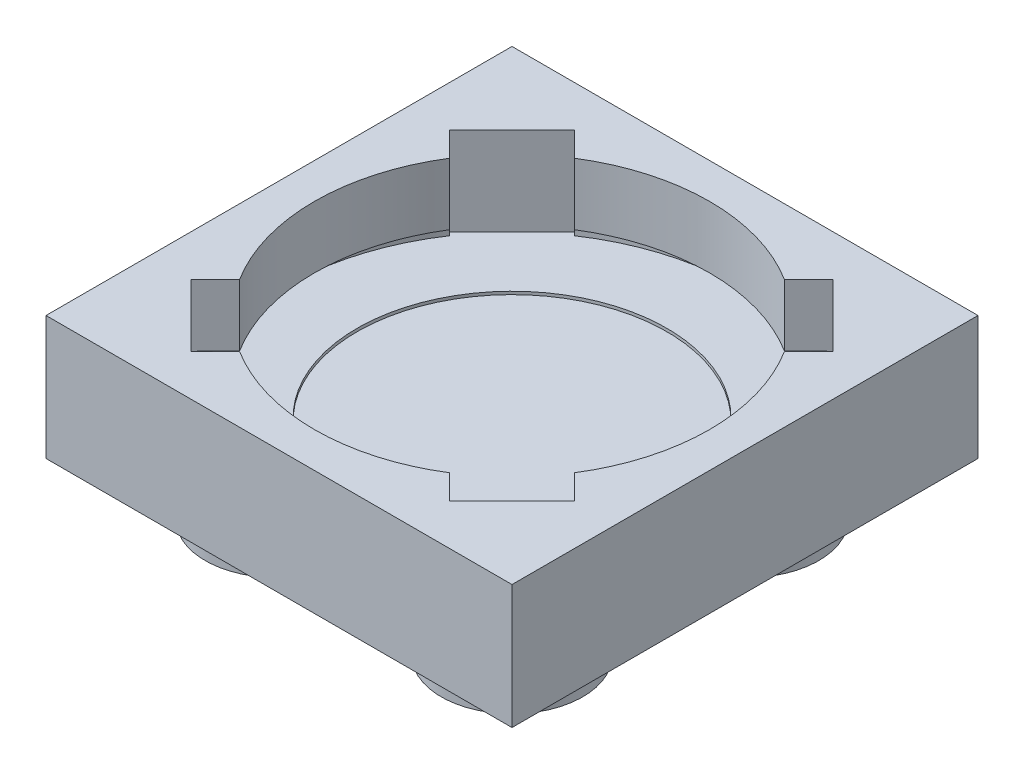
ISO-10303-21;
HEADER;
FILE_DESCRIPTION(('STEP AP214'),'2;1');
FILE_NAME('part.step','',(''),(''),'','','');
FILE_SCHEMA(('AUTOMOTIVE_DESIGN { 1 0 10303 214 1 1 1 1 }'));
ENDSEC;
DATA;
#1=APPLICATION_CONTEXT('core data for automotive mechanical design processes');
#2=APPLICATION_PROTOCOL_DEFINITION('international standard','automotive_design',2000,#1);
#3=PRODUCT_CONTEXT('',#1,'mechanical');
#4=PRODUCT('Part','Part','',(#3));
#5=PRODUCT_RELATED_PRODUCT_CATEGORY('part','',(#4));
#6=PRODUCT_DEFINITION_FORMATION('','',#4);
#7=PRODUCT_DEFINITION_CONTEXT('part definition',#1,'design');
#8=PRODUCT_DEFINITION('design','',#6,#7);
#9=PRODUCT_DEFINITION_SHAPE('','',#8);
#10=(LENGTH_UNIT() NAMED_UNIT(*) SI_UNIT(.MILLI.,.METRE.));
#11=(NAMED_UNIT(*) PLANE_ANGLE_UNIT() SI_UNIT($,.RADIAN.));
#12=(NAMED_UNIT(*) SI_UNIT($,.STERADIAN.) SOLID_ANGLE_UNIT());
#13=UNCERTAINTY_MEASURE_WITH_UNIT(LENGTH_MEASURE(1.E-05),#10,'distance_accuracy_value','');
#14=(GEOMETRIC_REPRESENTATION_CONTEXT(3) GLOBAL_UNCERTAINTY_ASSIGNED_CONTEXT((#13)) GLOBAL_UNIT_ASSIGNED_CONTEXT((#10,
#11,#12)) REPRESENTATION_CONTEXT('',''));
#15=CARTESIAN_POINT('',(0.,0.,0.));
#16=DIRECTION('',(0.,0.,1.));
#17=DIRECTION('',(1.,0.,0.));
#18=AXIS2_PLACEMENT_3D('',#15,#16,#17);
#19=CARTESIAN_POINT('',(7.9,9.47523086789974,-7.9));
#20=DIRECTION('',(0.,-1.,0.));
#21=DIRECTION('',(0.,0.,-1.));
#22=AXIS2_PLACEMENT_3D('',#19,#20,#21);
#23=CYLINDRICAL_SURFACE('',#22,6.7);
#24=CARTESIAN_POINT('',(7.9,-2.10000000000001,-7.9));
#25=DIRECTION('',(0.,1.,0.));
#26=DIRECTION('',(0.,0.,1.));
#27=AXIS2_PLACEMENT_3D('',#24,#25,#26);
#28=CIRCLE('',#27,6.7);
#29=CARTESIAN_POINT('',(11.4566983804663,-2.10000000000001,-13.5780187240259));
#30=VERTEX_POINT('',#29);
#31=CARTESIAN_POINT('',(4.34330161953374,-2.10000000000001,-13.5780187240259));
#32=VERTEX_POINT('',#31);
#33=EDGE_CURVE('E428',#30,#32,#28,.T.);
#34=ORIENTED_EDGE('',*,*,#33,.F.);
#35=DIRECTION('',(0.,-1.,0.));
#36=VECTOR('',#35,1.);
#37=CARTESIAN_POINT('',(11.4566983804663,9.47523086789974,-13.5780187240259));
#38=LINE('',#37,#36);
#39=CARTESIAN_POINT('',(11.4566983804663,0.,-13.5780187240259));
#40=VERTEX_POINT('',#39);
#41=EDGE_CURVE('E420',#30,#40,#38,.F.);
#42=ORIENTED_EDGE('',*,*,#41,.T.);
#43=CARTESIAN_POINT('',(7.9,0.,-7.9));
#44=DIRECTION('',(0.,-1.,0.));
#45=DIRECTION('',(0.,0.,-1.));
#46=AXIS2_PLACEMENT_3D('',#43,#44,#45);
#47=CIRCLE('',#46,6.7);
#48=CARTESIAN_POINT('',(4.34330161953375,0.,-13.5780187240259));
#49=VERTEX_POINT('',#48);
#50=EDGE_CURVE('E342',#49,#40,#47,.T.);
#51=ORIENTED_EDGE('',*,*,#50,.F.);
#52=DIRECTION('',(0.,-1.,0.));
#53=VECTOR('',#52,1.);
#54=CARTESIAN_POINT('',(4.34330161953375,9.47523086789974,-13.5780187240259));
#55=LINE('',#54,#53);
#56=EDGE_CURVE('E410',#32,#49,#55,.F.);
#57=ORIENTED_EDGE('',*,*,#56,.F.);
#58=EDGE_LOOP('',(#34,#42,#51,#57));
#59=FACE_BOUND('',#58,.T.);
#60=ADVANCED_FACE('F75',(#59),#23,.F.);
#61=CARTESIAN_POINT('',(7.9,-2.10000000000001,-7.9));
#62=DIRECTION('',(0.,1.,0.));
#63=DIRECTION('',(0.,0.,1.));
#64=AXIS2_PLACEMENT_3D('',#61,#62,#63);
#65=CIRCLE('',#64,6.7);
#66=CARTESIAN_POINT('',(13.5780187240259,-2.10000000000001,-4.34330161953374));
#67=VERTEX_POINT('',#66);
#68=CARTESIAN_POINT('',(13.5780187240259,-2.10000000000001,-11.4566983804662));
#69=VERTEX_POINT('',#68);
#70=EDGE_CURVE('E508',#67,#69,#65,.T.);
#71=ORIENTED_EDGE('',*,*,#70,.F.);
#72=DIRECTION('',(0.,-1.,0.));
#73=VECTOR('',#72,1.);
#74=CARTESIAN_POINT('',(13.5780187240259,9.47523086789974,-4.34330161953374));
#75=LINE('',#74,#73);
#76=CARTESIAN_POINT('',(13.5780187240259,0.,-4.34330161953374));
#77=VERTEX_POINT('',#76);
#78=EDGE_CURVE('E416',#67,#77,#75,.F.);
#79=ORIENTED_EDGE('',*,*,#78,.T.);
#80=CARTESIAN_POINT('',(13.5780187240259,0.,-11.4566983804662));
#81=VERTEX_POINT('',#80);
#82=EDGE_CURVE('E346',#81,#77,#47,.T.);
#83=ORIENTED_EDGE('',*,*,#82,.F.);
#84=DIRECTION('',(0.,-1.,0.));
#85=VECTOR('',#84,1.);
#86=CARTESIAN_POINT('',(13.5780187240259,9.47523086789974,-11.4566983804662));
#87=LINE('',#86,#85);
#88=EDGE_CURVE('E422',#69,#81,#87,.F.);
#89=ORIENTED_EDGE('',*,*,#88,.F.);
#90=EDGE_LOOP('',(#71,#79,#83,#89));
#91=FACE_BOUND('',#90,.T.);
#92=ADVANCED_FACE('F506',(#91),#23,.F.);
#93=CARTESIAN_POINT('',(7.9,-2.10000000000001,-7.9));
#94=DIRECTION('',(0.,1.,0.));
#95=DIRECTION('',(0.,0.,1.));
#96=AXIS2_PLACEMENT_3D('',#93,#94,#95);
#97=CIRCLE('',#96,6.7);
#98=CARTESIAN_POINT('',(4.34330161953368,-2.10000000000001,-2.22198127597414));
#99=VERTEX_POINT('',#98);
#100=CARTESIAN_POINT('',(11.4566983804663,-2.10000000000001,-2.2219812759741));
#101=VERTEX_POINT('',#100);
#102=EDGE_CURVE('E520',#99,#101,#97,.T.);
#103=ORIENTED_EDGE('',*,*,#102,.F.);
#104=DIRECTION('',(0.,-1.,0.));
#105=VECTOR('',#104,1.);
#106=CARTESIAN_POINT('',(4.34330161953368,9.47523086789974,-2.22198127597414));
#107=LINE('',#106,#105);
#108=CARTESIAN_POINT('',(4.34330161953368,0.,-2.22198127597414));
#109=VERTEX_POINT('',#108);
#110=EDGE_CURVE('E412',#99,#109,#107,.F.);
#111=ORIENTED_EDGE('',*,*,#110,.T.);
#112=CARTESIAN_POINT('',(11.4566983804663,0.,-2.2219812759741));
#113=VERTEX_POINT('',#112);
#114=EDGE_CURVE('E602',#113,#109,#47,.T.);
#115=ORIENTED_EDGE('',*,*,#114,.F.);
#116=DIRECTION('',(0.,-1.,0.));
#117=VECTOR('',#116,1.);
#118=CARTESIAN_POINT('',(11.4566983804663,9.47523086789974,-2.2219812759741));
#119=LINE('',#118,#117);
#120=EDGE_CURVE('E418',#101,#113,#119,.F.);
#121=ORIENTED_EDGE('',*,*,#120,.F.);
#122=EDGE_LOOP('',(#103,#111,#115,#121));
#123=FACE_BOUND('',#122,.T.);
#124=ADVANCED_FACE('F572',(#123),#23,.F.);
#125=CARTESIAN_POINT('',(0.,-3.,0.));
#126=DIRECTION('',(0.,-1.,0.));
#127=DIRECTION('',(0.,0.,-1.));
#128=AXIS2_PLACEMENT_3D('',#125,#126,#127);
#129=PLANE('',#128);
#130=CARTESIAN_POINT('',(7.9,-3.00000000000001,-7.9));
#131=DIRECTION('',(0.,1.,0.));
#132=DIRECTION('',(0.,0.,1.));
#133=AXIS2_PLACEMENT_3D('',#130,#131,#132);
#134=CIRCLE('',#133,7.7);
#135=CARTESIAN_POINT('',(12.1797517973477,-3.00000000000001,-14.3010721409073));
#136=VERTEX_POINT('',#135);
#137=CARTESIAN_POINT('',(3.62024820265235,-3.00000000000001,-14.3010721409073));
#138=VERTEX_POINT('',#137);
#139=EDGE_CURVE('E271',#136,#138,#134,.T.);
#140=ORIENTED_EDGE('',*,*,#139,.T.);
#141=DIRECTION('',(-0.707106781186549,0.,-0.707106781186546));
#142=VECTOR('',#141,1.);
#143=CARTESIAN_POINT('',(8.96066017177982,-3.,-8.96066017177984));
#144=LINE('',#143,#142);
#145=CARTESIAN_POINT('',(3.5159379566434,-3.,-14.4053823869162));
#146=VERTEX_POINT('',#145);
#147=EDGE_CURVE('E330',#138,#146,#144,.T.);
#148=ORIENTED_EDGE('',*,*,#147,.T.);
#149=DIRECTION('',(0.707106781186547,0.,-0.707106781186548));
#150=VECTOR('',#149,1.);
#151=CARTESIAN_POINT('',(-5.44472221513642,-3.,-5.44472221513641));
#152=LINE('',#151,#150);
#153=CARTESIAN_POINT('',(1.39461761308377,-3.,-12.2840620433566));
#154=VERTEX_POINT('',#153);
#155=EDGE_CURVE('E331',#154,#146,#152,.T.);
#156=ORIENTED_EDGE('',*,*,#155,.F.);
#157=DIRECTION('',(-0.707106781186547,0.,-0.707106781186548));
#158=VECTOR('',#157,1.);
#159=CARTESIAN_POINT('',(6.83933982822018,-3.,-6.83933982822017));
#160=LINE('',#159,#158);
#161=CARTESIAN_POINT('',(1.49892785909271,-3.00000000000001,-12.1797517973477));
#162=VERTEX_POINT('',#161);
#163=EDGE_CURVE('E335',#162,#154,#160,.T.);
#164=ORIENTED_EDGE('',*,*,#163,.F.);
#165=CARTESIAN_POINT('',(1.49892785909266,-3.,-3.62024820265241));
#166=VERTEX_POINT('',#165);
#167=EDGE_CURVE('E90',#162,#166,#134,.T.);
#168=ORIENTED_EDGE('',*,*,#167,.T.);
#169=DIRECTION('',(-0.707106781186554,0.,0.707106781186541));
#170=VECTOR('',#169,1.);
#171=CARTESIAN_POINT('',(6.83933982822017,-3.,-8.96066017177983));
#172=LINE('',#171,#170);
#173=CARTESIAN_POINT('',(1.39461761308372,-3.,-3.51593795664347));
#174=VERTEX_POINT('',#173);
#175=EDGE_CURVE('E309',#166,#174,#172,.T.);
#176=ORIENTED_EDGE('',*,*,#175,.T.);
#177=DIRECTION('',(-0.70710678118654,0.,-0.707106781186555));
#178=VECTOR('',#177,1.);
#179=CARTESIAN_POINT('',(10.3552777848634,-3.,5.44472221513644));
#180=LINE('',#179,#178);
#181=CARTESIAN_POINT('',(3.51593795664333,-3.,-1.39461761308381));
#182=VERTEX_POINT('',#181);
#183=EDGE_CURVE('E310',#182,#174,#180,.T.);
#184=ORIENTED_EDGE('',*,*,#183,.F.);
#185=DIRECTION('',(-0.707106781186556,0.,0.707106781186539));
#186=VECTOR('',#185,1.);
#187=CARTESIAN_POINT('',(8.96066017177982,-3.,-6.83933982822017));
#188=LINE('',#187,#186);
#189=CARTESIAN_POINT('',(3.62024820265228,-3.00000000000001,-1.49892785909275));
#190=VERTEX_POINT('',#189);
#191=EDGE_CURVE('E313',#190,#182,#188,.T.);
#192=ORIENTED_EDGE('',*,*,#191,.F.);
#193=CARTESIAN_POINT('',(12.1797517973477,-3.,-1.49892785909271));
#194=VERTEX_POINT('',#193);
#195=EDGE_CURVE('E97',#190,#194,#134,.T.);
#196=ORIENTED_EDGE('',*,*,#195,.T.);
#197=DIRECTION('',(0.707106781186549,0.,0.707106781186546));
#198=VECTOR('',#197,1.);
#199=CARTESIAN_POINT('',(6.83933982822018,-3.,-6.83933982822016));
#200=LINE('',#199,#198);
#201=CARTESIAN_POINT('',(12.2840620433566,-3.,-1.39461761308376));
#202=VERTEX_POINT('',#201);
#203=EDGE_CURVE('E295',#194,#202,#200,.T.);
#204=ORIENTED_EDGE('',*,*,#203,.T.);
#205=DIRECTION('',(-0.707106781186547,0.,0.707106781186548));
#206=VECTOR('',#205,1.);
#207=CARTESIAN_POINT('',(21.2447222151364,-3.,-10.3552777848636));
#208=LINE('',#207,#206);
#209=CARTESIAN_POINT('',(14.4053823869162,-3.,-3.5159379566434));
#210=VERTEX_POINT('',#209);
#211=EDGE_CURVE('E286',#210,#202,#208,.T.);
#212=ORIENTED_EDGE('',*,*,#211,.F.);
#213=DIRECTION('',(0.707106781186547,0.,0.707106781186548));
#214=VECTOR('',#213,1.);
#215=CARTESIAN_POINT('',(8.96066017177982,-3.,-8.96066017177983));
#216=LINE('',#215,#214);
#217=CARTESIAN_POINT('',(14.3010721409073,-3.00000000000001,-3.62024820265234));
#218=VERTEX_POINT('',#217);
#219=EDGE_CURVE('E276',#218,#210,#216,.T.);
#220=ORIENTED_EDGE('',*,*,#219,.F.);
#221=CARTESIAN_POINT('',(14.3010721409073,-3.,-12.1797517973476));
#222=VERTEX_POINT('',#221);
#223=EDGE_CURVE('E259',#218,#222,#134,.T.);
#224=ORIENTED_EDGE('',*,*,#223,.T.);
#225=DIRECTION('',(0.707106781186549,0.,-0.707106781186546));
#226=VECTOR('',#225,1.);
#227=CARTESIAN_POINT('',(8.96066017177984,-3.,-6.83933982822018));
#228=LINE('',#227,#226);
#229=CARTESIAN_POINT('',(14.4053823869163,-3.,-12.2840620433566));
#230=VERTEX_POINT('',#229);
#231=EDGE_CURVE('E475',#222,#230,#228,.T.);
#232=ORIENTED_EDGE('',*,*,#231,.T.);
#233=DIRECTION('',(0.707106781186545,0.,0.70710678118655));
#234=VECTOR('',#233,1.);
#235=CARTESIAN_POINT('',(5.44472221513646,-3.,-21.2447222151364));
#236=LINE('',#235,#234);
#237=CARTESIAN_POINT('',(12.2840620433566,-3.,-14.4053823869162));
#238=VERTEX_POINT('',#237);
#239=EDGE_CURVE('E476',#238,#230,#236,.T.);
#240=ORIENTED_EDGE('',*,*,#239,.F.);
#241=DIRECTION('',(0.707106781186551,0.,-0.707106781186544));
#242=VECTOR('',#241,1.);
#243=CARTESIAN_POINT('',(6.83933982822017,-3.,-8.96066017177982));
#244=LINE('',#243,#242);
#245=EDGE_CURVE('E479',#136,#238,#244,.T.);
#246=ORIENTED_EDGE('',*,*,#245,.F.);
#247=EDGE_LOOP('',(#140,#148,#156,#164,#168,#176,#184,#192,#196,#204,#212,#220,#224,#232,#240,#246));
#248=FACE_BOUND('',#247,.T.);
#249=CARTESIAN_POINT('',(7.9,-3.,-7.9));
#250=DIRECTION('',(0.,1.,0.));
#251=DIRECTION('',(0.,0.,1.));
#252=AXIS2_PLACEMENT_3D('',#249,#250,#251);
#253=CIRCLE('',#252,5.25);
#254=CARTESIAN_POINT('',(7.9,-3.,-2.65));
#255=VERTEX_POINT('',#254);
#256=EDGE_CURVE('E345',#255,#255,#253,.T.);
#257=ORIENTED_EDGE('',*,*,#256,.F.);
#258=EDGE_LOOP('',(#257));
#259=FACE_BOUND('',#258,.T.);
#260=ADVANCED_FACE('F284',(#248,#259),#129,.F.);
#261=CARTESIAN_POINT('',(3.9,-6.,-3.9));
#262=DIRECTION('',(0.,-1.,0.));
#263=DIRECTION('',(0.,0.,-1.));
#264=AXIS2_PLACEMENT_3D('',#261,#262,#263);
#265=PLANE('',#264);
#266=CARTESIAN_POINT('',(3.9,-6.,-3.9));
#267=DIRECTION('',(0.,-1.,0.));
#268=DIRECTION('',(0.,0.,-1.));
#269=AXIS2_PLACEMENT_3D('',#266,#267,#268);
#270=CIRCLE('',#269,2.4);
#271=CARTESIAN_POINT('',(3.9,-6.,-6.3));
#272=VERTEX_POINT('',#271);
#273=EDGE_CURVE('E405',#272,#272,#270,.T.);
#274=ORIENTED_EDGE('',*,*,#273,.T.);
#275=EDGE_LOOP('',(#274));
#276=FACE_BOUND('',#275,.T.);
#277=ADVANCED_FACE('F77',(#276),#265,.T.);
#278=CARTESIAN_POINT('',(3.9,-6.,-3.9));
#279=DIRECTION('',(0.,1.,0.));
#280=DIRECTION('',(0.,0.,1.));
#281=AXIS2_PLACEMENT_3D('',#278,#279,#280);
#282=CYLINDRICAL_SURFACE('',#281,2.4);
#283=ORIENTED_EDGE('',*,*,#273,.F.);
#284=EDGE_LOOP('',(#283));
#285=FACE_BOUND('',#284,.T.);
#286=CARTESIAN_POINT('',(3.9,-4.2,-3.9));
#287=DIRECTION('',(0.,-1.,0.));
#288=DIRECTION('',(0.,0.,-1.));
#289=AXIS2_PLACEMENT_3D('',#286,#287,#288);
#290=CIRCLE('',#289,2.4);
#291=CARTESIAN_POINT('',(3.9,-4.2,-6.3));
#292=VERTEX_POINT('',#291);
#293=EDGE_CURVE('E402',#292,#292,#290,.T.);
#294=ORIENTED_EDGE('',*,*,#293,.T.);
#295=EDGE_LOOP('',(#294));
#296=FACE_BOUND('',#295,.T.);
#297=ADVANCED_FACE('F853',(#285,#296),#282,.T.);
#298=CARTESIAN_POINT('',(3.9,-6.,-11.9));
#299=DIRECTION('',(0.,-1.,0.));
#300=DIRECTION('',(0.,0.,-1.));
#301=AXIS2_PLACEMENT_3D('',#298,#299,#300);
#302=PLANE('',#301);
#303=CARTESIAN_POINT('',(3.9,-6.,-11.9));
#304=DIRECTION('',(0.,-1.,0.));
#305=DIRECTION('',(0.,0.,-1.));
#306=AXIS2_PLACEMENT_3D('',#303,#304,#305);
#307=CIRCLE('',#306,2.4);
#308=CARTESIAN_POINT('',(3.9,-6.,-14.3));
#309=VERTEX_POINT('',#308);
#310=EDGE_CURVE('E399',#309,#309,#307,.T.);
#311=ORIENTED_EDGE('',*,*,#310,.T.);
#312=EDGE_LOOP('',(#311));
#313=FACE_BOUND('',#312,.T.);
#314=ADVANCED_FACE('F842',(#313),#302,.T.);
#315=CARTESIAN_POINT('',(3.9,-6.,-11.9));
#316=DIRECTION('',(0.,1.,0.));
#317=DIRECTION('',(0.,0.,1.));
#318=AXIS2_PLACEMENT_3D('',#315,#316,#317);
#319=CYLINDRICAL_SURFACE('',#318,2.4);
#320=ORIENTED_EDGE('',*,*,#310,.F.);
#321=EDGE_LOOP('',(#320));
#322=FACE_BOUND('',#321,.T.);
#323=CARTESIAN_POINT('',(3.9,-4.2,-11.9));
#324=DIRECTION('',(0.,-1.,0.));
#325=DIRECTION('',(0.,0.,-1.));
#326=AXIS2_PLACEMENT_3D('',#323,#324,#325);
#327=CIRCLE('',#326,2.4);
#328=CARTESIAN_POINT('',(3.9,-4.2,-14.3));
#329=VERTEX_POINT('',#328);
#330=EDGE_CURVE('E391',#329,#329,#327,.T.);
#331=ORIENTED_EDGE('',*,*,#330,.T.);
#332=EDGE_LOOP('',(#331));
#333=FACE_BOUND('',#332,.T.);
#334=ADVANCED_FACE('F837',(#322,#333),#319,.T.);
#335=CARTESIAN_POINT('',(0.,-4.2,0.));
#336=DIRECTION('',(-1.,0.,0.));
#337=DIRECTION('',(0.,0.,1.));
#338=AXIS2_PLACEMENT_3D('',#335,#336,#337);
#339=PLANE('',#338);
#340=DIRECTION('',(0.,0.,1.));
#341=VECTOR('',#340,1.);
#342=CARTESIAN_POINT('',(0.,0.,0.));
#343=LINE('',#342,#341);
#344=CARTESIAN_POINT('',(0.,0.,-15.8));
#345=VERTEX_POINT('',#344);
#346=CARTESIAN_POINT('',(0.,0.,0.));
#347=VERTEX_POINT('',#346);
#348=EDGE_CURVE('E362',#345,#347,#343,.T.);
#349=ORIENTED_EDGE('',*,*,#348,.F.);
#350=DIRECTION('',(0.,1.,0.));
#351=VECTOR('',#350,1.);
#352=CARTESIAN_POINT('',(0.,-4.2,-15.8));
#353=LINE('',#352,#351);
#354=CARTESIAN_POINT('',(0.,-4.2,-15.8));
#355=VERTEX_POINT('',#354);
#356=EDGE_CURVE('E389',#355,#345,#353,.T.);
#357=ORIENTED_EDGE('',*,*,#356,.F.);
#358=DIRECTION('',(0.,0.,1.));
#359=VECTOR('',#358,1.);
#360=CARTESIAN_POINT('',(0.,-4.2,0.));
#361=LINE('',#360,#359);
#362=CARTESIAN_POINT('',(0.,-4.2,0.));
#363=VERTEX_POINT('',#362);
#364=EDGE_CURVE('E365',#355,#363,#361,.T.);
#365=ORIENTED_EDGE('',*,*,#364,.T.);
#366=DIRECTION('',(0.,1.,0.));
#367=VECTOR('',#366,1.);
#368=CARTESIAN_POINT('',(0.,-4.2,0.));
#369=LINE('',#368,#367);
#370=EDGE_CURVE('E378',#363,#347,#369,.T.);
#371=ORIENTED_EDGE('',*,*,#370,.T.);
#372=EDGE_LOOP('',(#349,#357,#365,#371));
#373=FACE_BOUND('',#372,.T.);
#374=ADVANCED_FACE('F841',(#373),#339,.T.);
#375=CARTESIAN_POINT('',(0.,-4.2,-15.8));
#376=DIRECTION('',(0.,0.,-1.));
#377=DIRECTION('',(-1.,0.,0.));
#378=AXIS2_PLACEMENT_3D('',#375,#376,#377);
#379=PLANE('',#378);
#380=DIRECTION('',(-1.,0.,0.));
#381=VECTOR('',#380,1.);
#382=CARTESIAN_POINT('',(0.,0.,-15.8));
#383=LINE('',#382,#381);
#384=CARTESIAN_POINT('',(15.8,0.,-15.8));
#385=VERTEX_POINT('',#384);
#386=EDGE_CURVE('E369',#385,#345,#383,.T.);
#387=ORIENTED_EDGE('',*,*,#386,.F.);
#388=DIRECTION('',(0.,1.,0.));
#389=VECTOR('',#388,1.);
#390=CARTESIAN_POINT('',(15.8,-4.2,-15.8));
#391=LINE('',#390,#389);
#392=CARTESIAN_POINT('',(15.8,-4.2,-15.8));
#393=VERTEX_POINT('',#392);
#394=EDGE_CURVE('E392',#393,#385,#391,.T.);
#395=ORIENTED_EDGE('',*,*,#394,.F.);
#396=DIRECTION('',(-1.,0.,0.));
#397=VECTOR('',#396,1.);
#398=CARTESIAN_POINT('',(0.,-4.2,-15.8));
#399=LINE('',#398,#397);
#400=EDGE_CURVE('E375',#393,#355,#399,.T.);
#401=ORIENTED_EDGE('',*,*,#400,.T.);
#402=ORIENTED_EDGE('',*,*,#356,.T.);
#403=EDGE_LOOP('',(#387,#395,#401,#402));
#404=FACE_BOUND('',#403,.T.);
#405=ADVANCED_FACE('F902',(#404),#379,.T.);
#406=CARTESIAN_POINT('',(15.8,-4.2,0.));
#407=DIRECTION('',(1.,0.,0.));
#408=DIRECTION('',(0.,0.,-1.));
#409=AXIS2_PLACEMENT_3D('',#406,#407,#408);
#410=PLANE('',#409);
#411=DIRECTION('',(0.,0.,-1.));
#412=VECTOR('',#411,1.);
#413=CARTESIAN_POINT('',(15.8,0.,0.));
#414=LINE('',#413,#412);
#415=CARTESIAN_POINT('',(15.8,0.,0.));
#416=VERTEX_POINT('',#415);
#417=EDGE_CURVE('E384',#416,#385,#414,.T.);
#418=ORIENTED_EDGE('',*,*,#417,.F.);
#419=DIRECTION('',(0.,1.,0.));
#420=VECTOR('',#419,1.);
#421=CARTESIAN_POINT('',(15.8,-4.2,0.));
#422=LINE('',#421,#420);
#423=CARTESIAN_POINT('',(15.8,-4.2,0.));
#424=VERTEX_POINT('',#423);
#425=EDGE_CURVE('E394',#424,#416,#422,.T.);
#426=ORIENTED_EDGE('',*,*,#425,.F.);
#427=DIRECTION('',(0.,0.,-1.));
#428=VECTOR('',#427,1.);
#429=CARTESIAN_POINT('',(15.8,-4.2,0.));
#430=LINE('',#429,#428);
#431=EDGE_CURVE('E372',#424,#393,#430,.T.);
#432=ORIENTED_EDGE('',*,*,#431,.T.);
#433=ORIENTED_EDGE('',*,*,#394,.T.);
#434=EDGE_LOOP('',(#418,#426,#432,#433));
#435=FACE_BOUND('',#434,.T.);
#436=ADVANCED_FACE('F892',(#435),#410,.T.);
#437=CARTESIAN_POINT('',(0.,-4.2,0.));
#438=DIRECTION('',(0.,0.,1.));
#439=DIRECTION('',(1.,0.,0.));
#440=AXIS2_PLACEMENT_3D('',#437,#438,#439);
#441=PLANE('',#440);
#442=DIRECTION('',(1.,0.,0.));
#443=VECTOR('',#442,1.);
#444=CARTESIAN_POINT('',(0.,0.,0.));
#445=LINE('',#444,#443);
#446=EDGE_CURVE('E381',#347,#416,#445,.T.);
#447=ORIENTED_EDGE('',*,*,#446,.F.);
#448=ORIENTED_EDGE('',*,*,#370,.F.);
#449=DIRECTION('',(1.,0.,0.));
#450=VECTOR('',#449,1.);
#451=CARTESIAN_POINT('',(0.,-4.2,0.));
#452=LINE('',#451,#450);
#453=EDGE_CURVE('E368',#363,#424,#452,.T.);
#454=ORIENTED_EDGE('',*,*,#453,.T.);
#455=ORIENTED_EDGE('',*,*,#425,.T.);
#456=EDGE_LOOP('',(#447,#448,#454,#455));
#457=FACE_BOUND('',#456,.T.);
#458=ADVANCED_FACE('F828',(#457),#441,.T.);
#459=CARTESIAN_POINT('',(0.,-4.2,0.));
#460=DIRECTION('',(0.,-1.,0.));
#461=DIRECTION('',(0.,0.,-1.));
#462=AXIS2_PLACEMENT_3D('',#459,#460,#461);
#463=PLANE('',#462);
#464=CARTESIAN_POINT('',(11.9,-4.2,-3.9));
#465=DIRECTION('',(0.,-1.,0.));
#466=DIRECTION('',(0.,0.,-1.));
#467=AXIS2_PLACEMENT_3D('',#464,#465,#466);
#468=CIRCLE('',#467,2.4);
#469=CARTESIAN_POINT('',(11.9,-4.2,-6.3));
#470=VERTEX_POINT('',#469);
#471=EDGE_CURVE('E350',#470,#470,#468,.T.);
#472=ORIENTED_EDGE('',*,*,#471,.F.);
#473=EDGE_LOOP('',(#472));
#474=FACE_BOUND('',#473,.T.);
#475=CARTESIAN_POINT('',(11.9,-4.2,-11.9));
#476=DIRECTION('',(0.,-1.,0.));
#477=DIRECTION('',(0.,0.,-1.));
#478=AXIS2_PLACEMENT_3D('',#475,#476,#477);
#479=CIRCLE('',#478,2.4);
#480=CARTESIAN_POINT('',(11.9,-4.2,-14.3));
#481=VERTEX_POINT('',#480);
#482=EDGE_CURVE('E358',#481,#481,#479,.T.);
#483=ORIENTED_EDGE('',*,*,#482,.F.);
#484=EDGE_LOOP('',(#483));
#485=FACE_BOUND('',#484,.T.);
#486=ORIENTED_EDGE('',*,*,#364,.F.);
#487=ORIENTED_EDGE('',*,*,#400,.F.);
#488=ORIENTED_EDGE('',*,*,#431,.F.);
#489=ORIENTED_EDGE('',*,*,#453,.F.);
#490=EDGE_LOOP('',(#486,#487,#488,#489));
#491=FACE_BOUND('',#490,.T.);
#492=ORIENTED_EDGE('',*,*,#330,.F.);
#493=EDGE_LOOP('',(#492));
#494=FACE_BOUND('',#493,.T.);
#495=ORIENTED_EDGE('',*,*,#293,.F.);
#496=EDGE_LOOP('',(#495));
#497=FACE_BOUND('',#496,.T.);
#498=ADVANCED_FACE('F777',(#474,#485,#491,#494,#497),#463,.T.);
#499=CARTESIAN_POINT('',(0.,0.,0.));
#500=DIRECTION('',(0.,-1.,0.));
#501=DIRECTION('',(0.,0.,-1.));
#502=AXIS2_PLACEMENT_3D('',#499,#500,#501);
#503=PLANE('',#502);
#504=DIRECTION('',(0.707106781186545,0.,0.70710678118655));
#505=VECTOR('',#504,1.);
#506=CARTESIAN_POINT('',(5.44472221513646,0.,-21.2447222151364));
#507=LINE('',#506,#505);
#508=CARTESIAN_POINT('',(12.2840620433566,0.,-14.4053823869162));
#509=VERTEX_POINT('',#508);
#510=CARTESIAN_POINT('',(14.4053823869163,0.,-12.2840620433566));
#511=VERTEX_POINT('',#510);
#512=EDGE_CURVE('E449',#509,#511,#507,.T.);
#513=ORIENTED_EDGE('',*,*,#512,.T.);
#514=DIRECTION('',(0.707106781186549,0.,-0.707106781186546));
#515=VECTOR('',#514,1.);
#516=CARTESIAN_POINT('',(8.96066017177984,0.,-6.83933982822018));
#517=LINE('',#516,#515);
#518=EDGE_CURVE('E473',#81,#511,#517,.T.);
#519=ORIENTED_EDGE('',*,*,#518,.F.);
#520=ORIENTED_EDGE('',*,*,#82,.T.);
#521=DIRECTION('',(0.707106781186547,0.,0.707106781186548));
#522=VECTOR('',#521,1.);
#523=CARTESIAN_POINT('',(8.96066017177982,0.,-8.96066017177983));
#524=LINE('',#523,#522);
#525=CARTESIAN_POINT('',(14.4053823869162,0.,-3.5159379566434));
#526=VERTEX_POINT('',#525);
#527=EDGE_CURVE('E481',#77,#526,#524,.T.);
#528=ORIENTED_EDGE('',*,*,#527,.T.);
#529=DIRECTION('',(-0.707106781186547,0.,0.707106781186548));
#530=VECTOR('',#529,1.);
#531=CARTESIAN_POINT('',(21.2447222151364,0.,-10.3552777848636));
#532=LINE('',#531,#530);
#533=CARTESIAN_POINT('',(12.2840620433566,0.,-1.39461761308376));
#534=VERTEX_POINT('',#533);
#535=EDGE_CURVE('E300',#526,#534,#532,.T.);
#536=ORIENTED_EDGE('',*,*,#535,.T.);
#537=DIRECTION('',(0.707106781186549,0.,0.707106781186546));
#538=VECTOR('',#537,1.);
#539=CARTESIAN_POINT('',(6.83933982822018,0.,-6.83933982822016));
#540=LINE('',#539,#538);
#541=EDGE_CURVE('E289',#113,#534,#540,.T.);
#542=ORIENTED_EDGE('',*,*,#541,.F.);
#543=ORIENTED_EDGE('',*,*,#114,.T.);
#544=DIRECTION('',(-0.707106781186556,0.,0.707106781186539));
#545=VECTOR('',#544,1.);
#546=CARTESIAN_POINT('',(8.96066017177982,0.,-6.83933982822017));
#547=LINE('',#546,#545);
#548=CARTESIAN_POINT('',(3.51593795664333,0.,-1.39461761308381));
#549=VERTEX_POINT('',#548);
#550=EDGE_CURVE('E287',#109,#549,#547,.T.);
#551=ORIENTED_EDGE('',*,*,#550,.T.);
#552=DIRECTION('',(-0.70710678118654,0.,-0.707106781186555));
#553=VECTOR('',#552,1.);
#554=CARTESIAN_POINT('',(10.3552777848634,0.,5.44472221513644));
#555=LINE('',#554,#553);
#556=CARTESIAN_POINT('',(1.39461761308372,0.,-3.51593795664347));
#557=VERTEX_POINT('',#556);
#558=EDGE_CURVE('E292',#549,#557,#555,.T.);
#559=ORIENTED_EDGE('',*,*,#558,.T.);
#560=DIRECTION('',(-0.707106781186554,0.,0.707106781186541));
#561=VECTOR('',#560,1.);
#562=CARTESIAN_POINT('',(6.83933982822017,0.,-8.96066017177983));
#563=LINE('',#562,#561);
#564=CARTESIAN_POINT('',(2.22198127597406,0.,-4.34330161953381));
#565=VERTEX_POINT('',#564);
#566=EDGE_CURVE('E307',#565,#557,#563,.T.);
#567=ORIENTED_EDGE('',*,*,#566,.F.);
#568=CARTESIAN_POINT('',(2.2219812759741,0.,-11.4566983804663));
#569=VERTEX_POINT('',#568);
#570=EDGE_CURVE('E323',#565,#569,#47,.T.);
#571=ORIENTED_EDGE('',*,*,#570,.T.);
#572=DIRECTION('',(-0.707106781186547,0.,-0.707106781186548));
#573=VECTOR('',#572,1.);
#574=CARTESIAN_POINT('',(6.83933982822018,0.,-6.83933982822017));
#575=LINE('',#574,#573);
#576=CARTESIAN_POINT('',(1.39461761308377,0.,-12.2840620433566));
#577=VERTEX_POINT('',#576);
#578=EDGE_CURVE('E320',#569,#577,#575,.T.);
#579=ORIENTED_EDGE('',*,*,#578,.T.);
#580=DIRECTION('',(0.707106781186547,0.,-0.707106781186548));
#581=VECTOR('',#580,1.);
#582=CARTESIAN_POINT('',(-5.44472221513642,0.,-5.44472221513641));
#583=LINE('',#582,#581);
#584=CARTESIAN_POINT('',(3.5159379566434,0.,-14.4053823869162));
#585=VERTEX_POINT('',#584);
#586=EDGE_CURVE('E324',#577,#585,#583,.T.);
#587=ORIENTED_EDGE('',*,*,#586,.T.);
#588=DIRECTION('',(-0.707106781186549,0.,-0.707106781186546));
#589=VECTOR('',#588,1.);
#590=CARTESIAN_POINT('',(8.96066017177982,0.,-8.96066017177984));
#591=LINE('',#590,#589);
#592=EDGE_CURVE('E328',#49,#585,#591,.T.);
#593=ORIENTED_EDGE('',*,*,#592,.F.);
#594=ORIENTED_EDGE('',*,*,#50,.T.);
#595=DIRECTION('',(0.707106781186551,0.,-0.707106781186544));
#596=VECTOR('',#595,1.);
#597=CARTESIAN_POINT('',(6.83933982822017,0.,-8.96066017177982));
#598=LINE('',#597,#596);
#599=EDGE_CURVE('E337',#40,#509,#598,.T.);
#600=ORIENTED_EDGE('',*,*,#599,.T.);
#601=EDGE_LOOP('',(#513,#519,#520,#528,#536,#542,#543,#551,#559,#567,#571,#579,#587,#593,#594,#600));
#602=FACE_BOUND('',#601,.T.);
#603=ORIENTED_EDGE('',*,*,#348,.T.);
#604=ORIENTED_EDGE('',*,*,#446,.T.);
#605=ORIENTED_EDGE('',*,*,#417,.T.);
#606=ORIENTED_EDGE('',*,*,#386,.T.);
#607=EDGE_LOOP('',(#603,#604,#605,#606));
#608=FACE_BOUND('',#607,.T.);
#609=ADVANCED_FACE('F452',(#602,#608),#503,.F.);
#610=CARTESIAN_POINT('',(11.9,-6.,-11.9));
#611=DIRECTION('',(0.,1.,0.));
#612=DIRECTION('',(0.,0.,1.));
#613=AXIS2_PLACEMENT_3D('',#610,#611,#612);
#614=CYLINDRICAL_SURFACE('',#613,2.4);
#615=CARTESIAN_POINT('',(11.9,-6.,-11.9));
#616=DIRECTION('',(0.,-1.,0.));
#617=DIRECTION('',(0.,0.,-1.));
#618=AXIS2_PLACEMENT_3D('',#615,#616,#617);
#619=CIRCLE('',#618,2.4);
#620=CARTESIAN_POINT('',(11.9,-6.,-14.3));
#621=VERTEX_POINT('',#620);
#622=EDGE_CURVE('E359',#621,#621,#619,.T.);
#623=ORIENTED_EDGE('',*,*,#622,.F.);
#624=EDGE_LOOP('',(#623));
#625=FACE_BOUND('',#624,.T.);
#626=ORIENTED_EDGE('',*,*,#482,.T.);
#627=EDGE_LOOP('',(#626));
#628=FACE_BOUND('',#627,.T.);
#629=ADVANCED_FACE('F776',(#625,#628),#614,.T.);
#630=CARTESIAN_POINT('',(11.9,-6.,-11.9));
#631=DIRECTION('',(0.,-1.,0.));
#632=DIRECTION('',(0.,0.,-1.));
#633=AXIS2_PLACEMENT_3D('',#630,#631,#632);
#634=PLANE('',#633);
#635=ORIENTED_EDGE('',*,*,#622,.T.);
#636=EDGE_LOOP('',(#635));
#637=FACE_BOUND('',#636,.T.);
#638=ADVANCED_FACE('F817',(#637),#634,.T.);
#639=CARTESIAN_POINT('',(11.9,-6.,-3.9));
#640=DIRECTION('',(0.,1.,0.));
#641=DIRECTION('',(0.,0.,1.));
#642=AXIS2_PLACEMENT_3D('',#639,#640,#641);
#643=CYLINDRICAL_SURFACE('',#642,2.4);
#644=CARTESIAN_POINT('',(11.9,-6.,-3.9));
#645=DIRECTION('',(0.,-1.,0.));
#646=DIRECTION('',(0.,0.,-1.));
#647=AXIS2_PLACEMENT_3D('',#644,#645,#646);
#648=CIRCLE('',#647,2.4);
#649=CARTESIAN_POINT('',(11.9,-6.,-6.3));
#650=VERTEX_POINT('',#649);
#651=EDGE_CURVE('E355',#650,#650,#648,.T.);
#652=ORIENTED_EDGE('',*,*,#651,.F.);
#653=EDGE_LOOP('',(#652));
#654=FACE_BOUND('',#653,.T.);
#655=ORIENTED_EDGE('',*,*,#471,.T.);
#656=EDGE_LOOP('',(#655));
#657=FACE_BOUND('',#656,.T.);
#658=ADVANCED_FACE('F807',(#654,#657),#643,.T.);
#659=CARTESIAN_POINT('',(11.9,-6.,-3.9));
#660=DIRECTION('',(0.,-1.,0.));
#661=DIRECTION('',(0.,0.,-1.));
#662=AXIS2_PLACEMENT_3D('',#659,#660,#661);
#663=PLANE('',#662);
#664=ORIENTED_EDGE('',*,*,#651,.T.);
#665=EDGE_LOOP('',(#664));
#666=FACE_BOUND('',#665,.T.);
#667=ADVANCED_FACE('F797',(#666),#663,.T.);
#668=CARTESIAN_POINT('',(7.9,-3.1,-7.9));
#669=DIRECTION('',(0.,1.,0.));
#670=DIRECTION('',(0.,0.,1.));
#671=AXIS2_PLACEMENT_3D('',#668,#669,#670);
#672=CYLINDRICAL_SURFACE('',#671,5.25);
#673=CARTESIAN_POINT('',(7.9,-3.1,-7.9));
#674=DIRECTION('',(0.,1.,0.));
#675=DIRECTION('',(0.,0.,1.));
#676=AXIS2_PLACEMENT_3D('',#673,#674,#675);
#677=CIRCLE('',#676,5.25);
#678=CARTESIAN_POINT('',(7.9,-3.1,-2.65));
#679=VERTEX_POINT('',#678);
#680=EDGE_CURVE('E347',#679,#679,#677,.T.);
#681=ORIENTED_EDGE('',*,*,#680,.F.);
#682=EDGE_LOOP('',(#681));
#683=FACE_BOUND('',#682,.T.);
#684=ORIENTED_EDGE('',*,*,#256,.T.);
#685=EDGE_LOOP('',(#684));
#686=FACE_BOUND('',#685,.T.);
#687=ADVANCED_FACE('F582',(#683,#686),#672,.F.);
#688=CARTESIAN_POINT('',(7.9,-3.1,-7.9));
#689=DIRECTION('',(0.,1.,0.));
#690=DIRECTION('',(0.,0.,1.));
#691=AXIS2_PLACEMENT_3D('',#688,#689,#690);
#692=PLANE('',#691);
#693=ORIENTED_EDGE('',*,*,#680,.T.);
#694=EDGE_LOOP('',(#693));
#695=FACE_BOUND('',#694,.T.);
#696=ADVANCED_FACE('F576',(#695),#692,.T.);
#697=CARTESIAN_POINT('',(7.9,-2.10000000000001,-7.9));
#698=DIRECTION('',(0.,1.,0.));
#699=DIRECTION('',(0.,0.,1.));
#700=AXIS2_PLACEMENT_3D('',#697,#698,#699);
#701=CIRCLE('',#700,6.7);
#702=CARTESIAN_POINT('',(2.2219812759741,-2.10000000000001,-11.4566983804663));
#703=VERTEX_POINT('',#702);
#704=CARTESIAN_POINT('',(2.22198127597406,-2.10000000000001,-4.34330161953381));
#705=VERTEX_POINT('',#704);
#706=EDGE_CURVE('E527',#703,#705,#701,.T.);
#707=ORIENTED_EDGE('',*,*,#706,.F.);
#708=DIRECTION('',(0.,-1.,0.));
#709=VECTOR('',#708,1.);
#710=CARTESIAN_POINT('',(2.2219812759741,9.47523086789974,-11.4566983804663));
#711=LINE('',#710,#709);
#712=EDGE_CURVE('E408',#703,#569,#711,.F.);
#713=ORIENTED_EDGE('',*,*,#712,.T.);
#714=ORIENTED_EDGE('',*,*,#570,.F.);
#715=DIRECTION('',(0.,-1.,0.));
#716=VECTOR('',#715,1.);
#717=CARTESIAN_POINT('',(2.22198127597406,9.47523086789974,-4.34330161953381));
#718=LINE('',#717,#716);
#719=EDGE_CURVE('E414',#705,#565,#718,.F.);
#720=ORIENTED_EDGE('',*,*,#719,.F.);
#721=EDGE_LOOP('',(#707,#713,#714,#720));
#722=FACE_BOUND('',#721,.T.);
#723=ADVANCED_FACE('F568',(#722),#23,.F.);
#724=CARTESIAN_POINT('',(8.96066017177982,-8.65517446877458,-8.96066017177984));
#725=DIRECTION('',(0.707106781186546,0.,-0.707106781186549));
#726=DIRECTION('',(-0.707106781186549,0.,-0.707106781186546));
#727=AXIS2_PLACEMENT_3D('',#724,#725,#726);
#728=PLANE('',#727);
#729=ORIENTED_EDGE('',*,*,#147,.F.);
#730=DIRECTION('',(0.,1.,0.));
#731=VECTOR('',#730,1.);
#732=CARTESIAN_POINT('',(3.62024820265235,0.,-14.3010721409073));
#733=LINE('',#732,#731);
#734=CARTESIAN_POINT('',(3.62024820265235,-2.10000000000001,-14.3010721409073));
#735=VERTEX_POINT('',#734);
#736=EDGE_CURVE('E315',#138,#735,#733,.T.);
#737=ORIENTED_EDGE('',*,*,#736,.T.);
#738=DIRECTION('',(0.707106781186549,0.,0.707106781186546));
#739=VECTOR('',#738,1.);
#740=CARTESIAN_POINT('',(8.96066017177982,-2.10000000000001,-8.96066017177984));
#741=LINE('',#740,#739);
#742=EDGE_CURVE('E439',#735,#32,#741,.T.);
#743=ORIENTED_EDGE('',*,*,#742,.T.);
#744=ORIENTED_EDGE('',*,*,#56,.T.);
#745=ORIENTED_EDGE('',*,*,#592,.T.);
#746=DIRECTION('',(0.,1.,0.));
#747=VECTOR('',#746,1.);
#748=CARTESIAN_POINT('',(3.5159379566434,-8.65517446877458,-14.4053823869162));
#749=LINE('',#748,#747);
#750=EDGE_CURVE('E334',#146,#585,#749,.T.);
#751=ORIENTED_EDGE('',*,*,#750,.F.);
#752=EDGE_LOOP('',(#729,#737,#743,#744,#745,#751));
#753=FACE_BOUND('',#752,.T.);
#754=ADVANCED_FACE('F458',(#753),#728,.F.);
#755=CARTESIAN_POINT('',(-5.44472221513642,-8.65517446877458,-5.44472221513641));
#756=DIRECTION('',(0.707106781186548,0.,0.707106781186547));
#757=DIRECTION('',(0.707106781186547,0.,-0.707106781186548));
#758=AXIS2_PLACEMENT_3D('',#755,#756,#757);
#759=PLANE('',#758);
#760=ORIENTED_EDGE('',*,*,#155,.T.);
#761=ORIENTED_EDGE('',*,*,#750,.T.);
#762=ORIENTED_EDGE('',*,*,#586,.F.);
#763=DIRECTION('',(0.,1.,0.));
#764=VECTOR('',#763,1.);
#765=CARTESIAN_POINT('',(1.39461761308377,-8.65517446877458,-12.2840620433566));
#766=LINE('',#765,#764);
#767=EDGE_CURVE('E327',#154,#577,#766,.T.);
#768=ORIENTED_EDGE('',*,*,#767,.F.);
#769=EDGE_LOOP('',(#760,#761,#762,#768));
#770=FACE_BOUND('',#769,.T.);
#771=ADVANCED_FACE('F460',(#770),#759,.T.);
#772=CARTESIAN_POINT('',(6.83933982822018,-8.65517446877458,-6.83933982822017));
#773=DIRECTION('',(0.707106781186548,0.,-0.707106781186547));
#774=DIRECTION('',(-0.707106781186547,0.,-0.707106781186548));
#775=AXIS2_PLACEMENT_3D('',#772,#773,#774);
#776=PLANE('',#775);
#777=DIRECTION('',(0.,1.,0.));
#778=VECTOR('',#777,1.);
#779=CARTESIAN_POINT('',(1.49892785909271,0.,-12.1797517973477));
#780=LINE('',#779,#778);
#781=CARTESIAN_POINT('',(1.49892785909271,-2.10000000000001,-12.1797517973477));
#782=VERTEX_POINT('',#781);
#783=EDGE_CURVE('E466',#162,#782,#780,.T.);
#784=ORIENTED_EDGE('',*,*,#783,.F.);
#785=ORIENTED_EDGE('',*,*,#163,.T.);
#786=ORIENTED_EDGE('',*,*,#767,.T.);
#787=ORIENTED_EDGE('',*,*,#578,.F.);
#788=ORIENTED_EDGE('',*,*,#712,.F.);
#789=DIRECTION('',(0.707106781186547,0.,0.707106781186548));
#790=VECTOR('',#789,1.);
#791=CARTESIAN_POINT('',(6.83933982822018,-2.10000000000001,-6.83933982822017));
#792=LINE('',#791,#790);
#793=EDGE_CURVE('E529',#782,#703,#792,.T.);
#794=ORIENTED_EDGE('',*,*,#793,.F.);
#795=EDGE_LOOP('',(#784,#785,#786,#787,#788,#794));
#796=FACE_BOUND('',#795,.T.);
#797=ADVANCED_FACE('F609',(#796),#776,.T.);
#798=CARTESIAN_POINT('',(6.83933982822017,-8.65517446877458,-8.96066017177983));
#799=DIRECTION('',(-0.707106781186541,0.,-0.707106781186554));
#800=DIRECTION('',(-0.707106781186554,0.,0.707106781186541));
#801=AXIS2_PLACEMENT_3D('',#798,#799,#800);
#802=PLANE('',#801);
#803=ORIENTED_EDGE('',*,*,#175,.F.);
#804=DIRECTION('',(0.,1.,0.));
#805=VECTOR('',#804,1.);
#806=CARTESIAN_POINT('',(1.49892785909266,0.,-3.62024820265241));
#807=LINE('',#806,#805);
#808=CARTESIAN_POINT('',(1.49892785909266,-2.10000000000001,-3.62024820265241));
#809=VERTEX_POINT('',#808);
#810=EDGE_CURVE('E468',#166,#809,#807,.T.);
#811=ORIENTED_EDGE('',*,*,#810,.T.);
#812=DIRECTION('',(0.707106781186554,0.,-0.707106781186541));
#813=VECTOR('',#812,1.);
#814=CARTESIAN_POINT('',(6.83933982822017,-2.10000000000001,-8.96066017177983));
#815=LINE('',#814,#813);
#816=EDGE_CURVE('E524',#809,#705,#815,.T.);
#817=ORIENTED_EDGE('',*,*,#816,.T.);
#818=ORIENTED_EDGE('',*,*,#719,.T.);
#819=ORIENTED_EDGE('',*,*,#566,.T.);
#820=DIRECTION('',(0.,1.,0.));
#821=VECTOR('',#820,1.);
#822=CARTESIAN_POINT('',(1.39461761308372,-8.65517446877458,-3.51593795664347));
#823=LINE('',#822,#821);
#824=EDGE_CURVE('E312',#174,#557,#823,.T.);
#825=ORIENTED_EDGE('',*,*,#824,.F.);
#826=EDGE_LOOP('',(#803,#811,#817,#818,#819,#825));
#827=FACE_BOUND('',#826,.T.);
#828=ADVANCED_FACE('F537',(#827),#802,.F.);
#829=CARTESIAN_POINT('',(10.3552777848634,-8.65517446877458,5.44472221513644));
#830=DIRECTION('',(0.707106781186555,0.,-0.70710678118654));
#831=DIRECTION('',(-0.70710678118654,0.,-0.707106781186555));
#832=AXIS2_PLACEMENT_3D('',#829,#830,#831);
#833=PLANE('',#832);
#834=ORIENTED_EDGE('',*,*,#183,.T.);
#835=ORIENTED_EDGE('',*,*,#824,.T.);
#836=ORIENTED_EDGE('',*,*,#558,.F.);
#837=DIRECTION('',(0.,1.,0.));
#838=VECTOR('',#837,1.);
#839=CARTESIAN_POINT('',(3.51593795664333,-8.65517446877458,-1.39461761308381));
#840=LINE('',#839,#838);
#841=EDGE_CURVE('E306',#182,#549,#840,.T.);
#842=ORIENTED_EDGE('',*,*,#841,.F.);
#843=EDGE_LOOP('',(#834,#835,#836,#842));
#844=FACE_BOUND('',#843,.T.);
#845=ADVANCED_FACE('F612',(#844),#833,.T.);
#846=CARTESIAN_POINT('',(8.96066017177982,-8.65517446877458,-6.83933982822017));
#847=DIRECTION('',(-0.707106781186539,0.,-0.707106781186556));
#848=DIRECTION('',(-0.707106781186556,0.,0.707106781186539));
#849=AXIS2_PLACEMENT_3D('',#846,#847,#848);
#850=PLANE('',#849);
#851=DIRECTION('',(0.,1.,0.));
#852=VECTOR('',#851,1.);
#853=CARTESIAN_POINT('',(3.62024820265228,0.,-1.49892785909275));
#854=LINE('',#853,#852);
#855=CARTESIAN_POINT('',(3.62024820265228,-2.10000000000001,-1.49892785909275));
#856=VERTEX_POINT('',#855);
#857=EDGE_CURVE('E533',#190,#856,#854,.T.);
#858=ORIENTED_EDGE('',*,*,#857,.F.);
#859=ORIENTED_EDGE('',*,*,#191,.T.);
#860=ORIENTED_EDGE('',*,*,#841,.T.);
#861=ORIENTED_EDGE('',*,*,#550,.F.);
#862=ORIENTED_EDGE('',*,*,#110,.F.);
#863=DIRECTION('',(0.707106781186556,0.,-0.707106781186539));
#864=VECTOR('',#863,1.);
#865=CARTESIAN_POINT('',(8.96066017177982,-2.10000000000001,-6.83933982822017));
#866=LINE('',#865,#864);
#867=EDGE_CURVE('E522',#856,#99,#866,.T.);
#868=ORIENTED_EDGE('',*,*,#867,.F.);
#869=EDGE_LOOP('',(#858,#859,#860,#861,#862,#868));
#870=FACE_BOUND('',#869,.T.);
#871=ADVANCED_FACE('F599',(#870),#850,.T.);
#872=CARTESIAN_POINT('',(6.83933982822018,-8.65517446877458,-6.83933982822016));
#873=DIRECTION('',(-0.707106781186546,0.,0.707106781186549));
#874=DIRECTION('',(0.707106781186549,0.,0.707106781186546));
#875=AXIS2_PLACEMENT_3D('',#872,#873,#874);
#876=PLANE('',#875);
#877=ORIENTED_EDGE('',*,*,#203,.F.);
#878=DIRECTION('',(0.,1.,0.));
#879=VECTOR('',#878,1.);
#880=CARTESIAN_POINT('',(12.1797517973477,0.,-1.49892785909271));
#881=LINE('',#880,#879);
#882=CARTESIAN_POINT('',(12.1797517973477,-2.10000000000001,-1.49892785909271));
#883=VERTEX_POINT('',#882);
#884=EDGE_CURVE('E280',#194,#883,#881,.T.);
#885=ORIENTED_EDGE('',*,*,#884,.T.);
#886=DIRECTION('',(-0.707106781186549,0.,-0.707106781186546));
#887=VECTOR('',#886,1.);
#888=CARTESIAN_POINT('',(6.83933982822018,-2.10000000000001,-6.83933982822016));
#889=LINE('',#888,#887);
#890=EDGE_CURVE('E513',#883,#101,#889,.T.);
#891=ORIENTED_EDGE('',*,*,#890,.T.);
#892=ORIENTED_EDGE('',*,*,#120,.T.);
#893=ORIENTED_EDGE('',*,*,#541,.T.);
#894=DIRECTION('',(0.,1.,0.));
#895=VECTOR('',#894,1.);
#896=CARTESIAN_POINT('',(12.2840620433566,-8.65517446877458,-1.39461761308376));
#897=LINE('',#896,#895);
#898=EDGE_CURVE('E301',#202,#534,#897,.T.);
#899=ORIENTED_EDGE('',*,*,#898,.F.);
#900=EDGE_LOOP('',(#877,#885,#891,#892,#893,#899));
#901=FACE_BOUND('',#900,.T.);
#902=ADVANCED_FACE('F494',(#901),#876,.F.);
#903=CARTESIAN_POINT('',(21.2447222151364,-8.65517446877458,-10.3552777848636));
#904=DIRECTION('',(-0.707106781186548,0.,-0.707106781186547));
#905=DIRECTION('',(-0.707106781186547,0.,0.707106781186548));
#906=AXIS2_PLACEMENT_3D('',#903,#904,#905);
#907=PLANE('',#906);
#908=ORIENTED_EDGE('',*,*,#211,.T.);
#909=ORIENTED_EDGE('',*,*,#898,.T.);
#910=ORIENTED_EDGE('',*,*,#535,.F.);
#911=DIRECTION('',(0.,1.,0.));
#912=VECTOR('',#911,1.);
#913=CARTESIAN_POINT('',(14.4053823869162,-8.65517446877458,-3.5159379566434));
#914=LINE('',#913,#912);
#915=EDGE_CURVE('E298',#210,#526,#914,.T.);
#916=ORIENTED_EDGE('',*,*,#915,.F.);
#917=EDGE_LOOP('',(#908,#909,#910,#916));
#918=FACE_BOUND('',#917,.T.);
#919=ADVANCED_FACE('F497',(#918),#907,.T.);
#920=CARTESIAN_POINT('',(8.96066017177982,-8.65517446877458,-8.96066017177983));
#921=DIRECTION('',(-0.707106781186548,0.,0.707106781186547));
#922=DIRECTION('',(0.707106781186547,0.,0.707106781186548));
#923=AXIS2_PLACEMENT_3D('',#920,#921,#922);
#924=PLANE('',#923);
#925=DIRECTION('',(0.,1.,0.));
#926=VECTOR('',#925,1.);
#927=CARTESIAN_POINT('',(14.3010721409073,0.,-3.62024820265235));
#928=LINE('',#927,#926);
#929=CARTESIAN_POINT('',(14.3010721409073,-2.10000000000001,-3.62024820265234));
#930=VERTEX_POINT('',#929);
#931=EDGE_CURVE('E263',#218,#930,#928,.T.);
#932=ORIENTED_EDGE('',*,*,#931,.F.);
#933=ORIENTED_EDGE('',*,*,#219,.T.);
#934=ORIENTED_EDGE('',*,*,#915,.T.);
#935=ORIENTED_EDGE('',*,*,#527,.F.);
#936=ORIENTED_EDGE('',*,*,#78,.F.);
#937=DIRECTION('',(-0.707106781186547,0.,-0.707106781186548));
#938=VECTOR('',#937,1.);
#939=CARTESIAN_POINT('',(8.96066017177982,-2.10000000000001,-8.96066017177983));
#940=LINE('',#939,#938);
#941=EDGE_CURVE('E279',#930,#67,#940,.T.);
#942=ORIENTED_EDGE('',*,*,#941,.F.);
#943=EDGE_LOOP('',(#932,#933,#934,#935,#936,#942));
#944=FACE_BOUND('',#943,.T.);
#945=ADVANCED_FACE('F275',(#944),#924,.T.);
#946=CARTESIAN_POINT('',(8.96066017177984,-8.65517446877458,-6.83933982822018));
#947=DIRECTION('',(0.707106781186546,0.,0.707106781186549));
#948=DIRECTION('',(0.707106781186549,0.,-0.707106781186546));
#949=AXIS2_PLACEMENT_3D('',#946,#947,#948);
#950=PLANE('',#949);
#951=ORIENTED_EDGE('',*,*,#231,.F.);
#952=DIRECTION('',(0.,1.,0.));
#953=VECTOR('',#952,1.);
#954=CARTESIAN_POINT('',(14.3010721409073,0.,-12.1797517973476));
#955=LINE('',#954,#953);
#956=CARTESIAN_POINT('',(14.3010721409073,-2.10000000000001,-12.1797517973476));
#957=VERTEX_POINT('',#956);
#958=EDGE_CURVE('E266',#222,#957,#955,.T.);
#959=ORIENTED_EDGE('',*,*,#958,.T.);
#960=DIRECTION('',(-0.707106781186549,0.,0.707106781186546));
#961=VECTOR('',#960,1.);
#962=CARTESIAN_POINT('',(8.96066017177984,-2.10000000000001,-6.83933982822018));
#963=LINE('',#962,#961);
#964=EDGE_CURVE('E511',#957,#69,#963,.T.);
#965=ORIENTED_EDGE('',*,*,#964,.T.);
#966=ORIENTED_EDGE('',*,*,#88,.T.);
#967=ORIENTED_EDGE('',*,*,#518,.T.);
#968=DIRECTION('',(0.,1.,0.));
#969=VECTOR('',#968,1.);
#970=CARTESIAN_POINT('',(14.4053823869163,-8.65517446877458,-12.2840620433566));
#971=LINE('',#970,#969);
#972=EDGE_CURVE('E478',#230,#511,#971,.T.);
#973=ORIENTED_EDGE('',*,*,#972,.F.);
#974=EDGE_LOOP('',(#951,#959,#965,#966,#967,#973));
#975=FACE_BOUND('',#974,.T.);
#976=ADVANCED_FACE('F553',(#975),#950,.F.);
#977=CARTESIAN_POINT('',(5.44472221513646,-8.65517446877458,-21.2447222151364));
#978=DIRECTION('',(-0.70710678118655,0.,0.707106781186545));
#979=DIRECTION('',(0.707106781186545,0.,0.70710678118655));
#980=AXIS2_PLACEMENT_3D('',#977,#978,#979);
#981=PLANE('',#980);
#982=ORIENTED_EDGE('',*,*,#239,.T.);
#983=ORIENTED_EDGE('',*,*,#972,.T.);
#984=ORIENTED_EDGE('',*,*,#512,.F.);
#985=DIRECTION('',(0.,1.,0.));
#986=VECTOR('',#985,1.);
#987=CARTESIAN_POINT('',(12.2840620433566,-8.65517446877458,-14.4053823869162));
#988=LINE('',#987,#986);
#989=EDGE_CURVE('E445',#238,#509,#988,.T.);
#990=ORIENTED_EDGE('',*,*,#989,.F.);
#991=EDGE_LOOP('',(#982,#983,#984,#990));
#992=FACE_BOUND('',#991,.T.);
#993=ADVANCED_FACE('F557',(#992),#981,.T.);
#994=CARTESIAN_POINT('',(6.83933982822017,-8.65517446877458,-8.96066017177982));
#995=DIRECTION('',(0.707106781186544,0.,0.707106781186551));
#996=DIRECTION('',(0.707106781186551,0.,-0.707106781186544));
#997=AXIS2_PLACEMENT_3D('',#994,#995,#996);
#998=PLANE('',#997);
#999=DIRECTION('',(0.,1.,0.));
#1000=VECTOR('',#999,1.);
#1001=CARTESIAN_POINT('',(12.1797517973477,0.,-14.3010721409073));
#1002=LINE('',#1001,#1000);
#1003=CARTESIAN_POINT('',(12.1797517973477,-2.10000000000001,-14.3010721409073));
#1004=VERTEX_POINT('',#1003);
#1005=EDGE_CURVE('E13',#136,#1004,#1002,.T.);
#1006=ORIENTED_EDGE('',*,*,#1005,.F.);
#1007=ORIENTED_EDGE('',*,*,#245,.T.);
#1008=ORIENTED_EDGE('',*,*,#989,.T.);
#1009=ORIENTED_EDGE('',*,*,#599,.F.);
#1010=ORIENTED_EDGE('',*,*,#41,.F.);
#1011=DIRECTION('',(-0.707106781186551,0.,0.707106781186544));
#1012=VECTOR('',#1011,1.);
#1013=CARTESIAN_POINT('',(6.83933982822017,-2.10000000000001,-8.96066017177982));
#1014=LINE('',#1013,#1012);
#1015=EDGE_CURVE('E83',#1004,#30,#1014,.T.);
#1016=ORIENTED_EDGE('',*,*,#1015,.F.);
#1017=EDGE_LOOP('',(#1006,#1007,#1008,#1009,#1010,#1016));
#1018=FACE_BOUND('',#1017,.T.);
#1019=ADVANCED_FACE('F442',(#1018),#998,.T.);
#1020=CARTESIAN_POINT('',(2.45527778486359,-2.10000000000001,-13.3447222151364));
#1021=DIRECTION('',(0.,1.,0.));
#1022=DIRECTION('',(0.,0.,1.));
#1023=AXIS2_PLACEMENT_3D('',#1020,#1021,#1022);
#1024=PLANE('',#1023);
#1025=CARTESIAN_POINT('',(7.9,-2.10000000000001,-7.9));
#1026=DIRECTION('',(0.,1.,0.));
#1027=DIRECTION('',(0.,0.,1.));
#1028=AXIS2_PLACEMENT_3D('',#1025,#1026,#1027);
#1029=CIRCLE('',#1028,7.7);
#1030=EDGE_CURVE('E431',#1004,#735,#1029,.T.);
#1031=ORIENTED_EDGE('',*,*,#1030,.F.);
#1032=ORIENTED_EDGE('',*,*,#1015,.T.);
#1033=ORIENTED_EDGE('',*,*,#33,.T.);
#1034=ORIENTED_EDGE('',*,*,#742,.F.);
#1035=EDGE_LOOP('',(#1031,#1032,#1033,#1034));
#1036=FACE_BOUND('',#1035,.T.);
#1037=ADVANCED_FACE('F427',(#1036),#1024,.F.);
#1038=CARTESIAN_POINT('',(7.9,0.,-7.9));
#1039=DIRECTION('',(0.,1.,0.));
#1040=DIRECTION('',(0.,0.,1.));
#1041=AXIS2_PLACEMENT_3D('',#1038,#1039,#1040);
#1042=CYLINDRICAL_SURFACE('',#1041,7.7);
#1043=ORIENTED_EDGE('',*,*,#139,.F.);
#1044=ORIENTED_EDGE('',*,*,#1005,.T.);
#1045=ORIENTED_EDGE('',*,*,#1030,.T.);
#1046=ORIENTED_EDGE('',*,*,#736,.F.);
#1047=EDGE_LOOP('',(#1043,#1044,#1045,#1046));
#1048=FACE_BOUND('',#1047,.T.);
#1049=ADVANCED_FACE('F624',(#1048),#1042,.F.);
#1050=ORIENTED_EDGE('',*,*,#941,.T.);
#1051=ORIENTED_EDGE('',*,*,#70,.T.);
#1052=ORIENTED_EDGE('',*,*,#964,.F.);
#1053=EDGE_CURVE('E440',#930,#957,#1029,.T.);
#1054=ORIENTED_EDGE('',*,*,#1053,.F.);
#1055=EDGE_LOOP('',(#1050,#1051,#1052,#1054));
#1056=FACE_BOUND('',#1055,.T.);
#1057=ADVANCED_FACE('F623',(#1056),#1024,.F.);
#1058=ORIENTED_EDGE('',*,*,#931,.T.);
#1059=ORIENTED_EDGE('',*,*,#1053,.T.);
#1060=ORIENTED_EDGE('',*,*,#958,.F.);
#1061=ORIENTED_EDGE('',*,*,#223,.F.);
#1062=EDGE_LOOP('',(#1058,#1059,#1060,#1061));
#1063=FACE_BOUND('',#1062,.T.);
#1064=ADVANCED_FACE('F261',(#1063),#1042,.F.);
#1065=ORIENTED_EDGE('',*,*,#867,.T.);
#1066=ORIENTED_EDGE('',*,*,#102,.T.);
#1067=ORIENTED_EDGE('',*,*,#890,.F.);
#1068=EDGE_CURVE('E270',#856,#883,#1029,.T.);
#1069=ORIENTED_EDGE('',*,*,#1068,.F.);
#1070=EDGE_LOOP('',(#1065,#1066,#1067,#1069));
#1071=FACE_BOUND('',#1070,.T.);
#1072=ADVANCED_FACE('F615',(#1071),#1024,.F.);
#1073=ORIENTED_EDGE('',*,*,#857,.T.);
#1074=ORIENTED_EDGE('',*,*,#1068,.T.);
#1075=ORIENTED_EDGE('',*,*,#884,.F.);
#1076=ORIENTED_EDGE('',*,*,#195,.F.);
#1077=EDGE_LOOP('',(#1073,#1074,#1075,#1076));
#1078=FACE_BOUND('',#1077,.T.);
#1079=ADVANCED_FACE('F614',(#1078),#1042,.F.);
#1080=ORIENTED_EDGE('',*,*,#783,.T.);
#1081=EDGE_CURVE('E545',#782,#809,#1029,.T.);
#1082=ORIENTED_EDGE('',*,*,#1081,.T.);
#1083=ORIENTED_EDGE('',*,*,#810,.F.);
#1084=ORIENTED_EDGE('',*,*,#167,.F.);
#1085=EDGE_LOOP('',(#1080,#1082,#1083,#1084));
#1086=FACE_BOUND('',#1085,.T.);
#1087=ADVANCED_FACE('F542',(#1086),#1042,.F.);
#1088=ORIENTED_EDGE('',*,*,#793,.T.);
#1089=ORIENTED_EDGE('',*,*,#706,.T.);
#1090=ORIENTED_EDGE('',*,*,#816,.F.);
#1091=ORIENTED_EDGE('',*,*,#1081,.F.);
#1092=EDGE_LOOP('',(#1088,#1089,#1090,#1091));
#1093=FACE_BOUND('',#1092,.T.);
#1094=ADVANCED_FACE('F610',(#1093),#1024,.F.);
#1095=CLOSED_SHELL('',(#60,#92,#124,#260,#277,#297,#314,#334,#374,#405,#436,#458,#498,#609,#629,
#638,#658,#667,#687,#696,#723,#754,#771,#797,#828,#845,#871,#902,#919,#945,#976,#993,#1019,
#1037,#1049,#1057,#1064,#1072,#1079,#1087,#1094));
#1096=MANIFOLD_SOLID_BREP('B2',#1095);
#1097=ADVANCED_BREP_SHAPE_REPRESENTATION('',(#18,#1096),#14);
#1098=SHAPE_DEFINITION_REPRESENTATION(#9,#1097);
ENDSEC;
END-ISO-10303-21;
